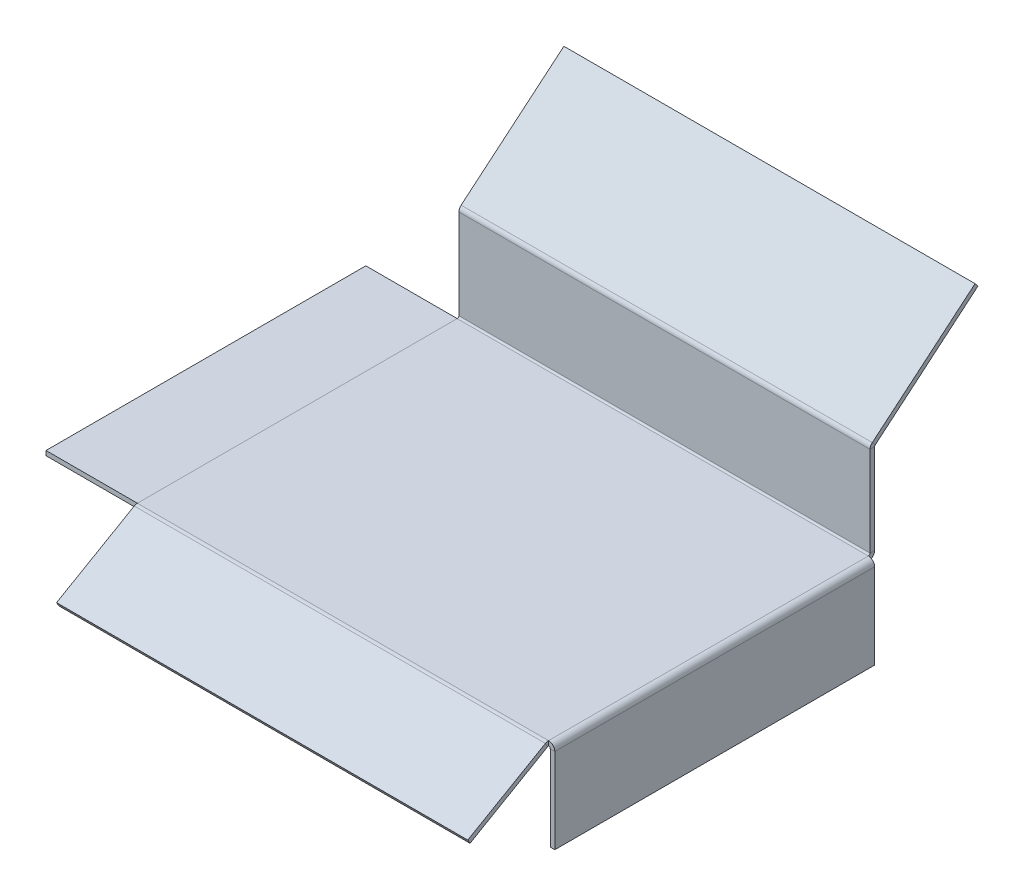
ISO-10303-21;
HEADER;
FILE_DESCRIPTION(('STEP AP214'),'2;1');
FILE_NAME('part.step','',(''),(''),'','','');
FILE_SCHEMA(('AUTOMOTIVE_DESIGN { 1 0 10303 214 1 1 1 1 }'));
ENDSEC;
DATA;
#1=APPLICATION_CONTEXT('core data for automotive mechanical design processes');
#2=APPLICATION_PROTOCOL_DEFINITION('international standard','automotive_design',2000,#1);
#3=PRODUCT_CONTEXT('',#1,'mechanical');
#4=PRODUCT('Part','Part','',(#3));
#5=PRODUCT_RELATED_PRODUCT_CATEGORY('part','',(#4));
#6=PRODUCT_DEFINITION_FORMATION('','',#4);
#7=PRODUCT_DEFINITION_CONTEXT('part definition',#1,'design');
#8=PRODUCT_DEFINITION('design','',#6,#7);
#9=PRODUCT_DEFINITION_SHAPE('','',#8);
#10=(LENGTH_UNIT() NAMED_UNIT(*) SI_UNIT(.MILLI.,.METRE.));
#11=(NAMED_UNIT(*) PLANE_ANGLE_UNIT() SI_UNIT($,.RADIAN.));
#12=(NAMED_UNIT(*) SI_UNIT($,.STERADIAN.) SOLID_ANGLE_UNIT());
#13=UNCERTAINTY_MEASURE_WITH_UNIT(LENGTH_MEASURE(1.E-05),#10,'distance_accuracy_value','');
#14=(GEOMETRIC_REPRESENTATION_CONTEXT(3) GLOBAL_UNCERTAINTY_ASSIGNED_CONTEXT((#13)) GLOBAL_UNIT_ASSIGNED_CONTEXT((#10,
#11,#12)) REPRESENTATION_CONTEXT('',''));
#15=CARTESIAN_POINT('',(0.,0.,0.));
#16=DIRECTION('',(0.,0.,1.));
#17=DIRECTION('',(1.,0.,0.));
#18=AXIS2_PLACEMENT_3D('',#15,#16,#17);
#19=CARTESIAN_POINT('',(-40.,-2.,0.));
#20=DIRECTION('',(0.,0.,-1.));
#21=DIRECTION('',(-1.,0.,0.));
#22=AXIS2_PLACEMENT_3D('',#19,#20,#21);
#23=PLANE('',#22);
#24=DIRECTION('',(0.,1.,0.));
#25=VECTOR('',#24,1.);
#26=CARTESIAN_POINT('',(0.,-2.,0.));
#27=LINE('',#26,#25);
#28=CARTESIAN_POINT('',(0.,-2.,0.));
#29=VERTEX_POINT('',#28);
#30=CARTESIAN_POINT('',(0.,0.,0.));
#31=VERTEX_POINT('',#30);
#32=EDGE_CURVE('E194',#29,#31,#27,.T.);
#33=ORIENTED_EDGE('',*,*,#32,.T.);
#34=DIRECTION('',(1.,0.,0.));
#35=VECTOR('',#34,1.);
#36=CARTESIAN_POINT('',(-40.,0.,0.));
#37=LINE('',#36,#35);
#38=CARTESIAN_POINT('',(-40.,0.,0.));
#39=VERTEX_POINT('',#38);
#40=EDGE_CURVE('E14',#39,#31,#37,.T.);
#41=ORIENTED_EDGE('',*,*,#40,.F.);
#42=DIRECTION('',(0.,1.,0.));
#43=VECTOR('',#42,1.);
#44=CARTESIAN_POINT('',(-40.,-2.,0.));
#45=LINE('',#44,#43);
#46=CARTESIAN_POINT('',(-40.,-2.,0.));
#47=VERTEX_POINT('',#46);
#48=EDGE_CURVE('E182',#47,#39,#45,.T.);
#49=ORIENTED_EDGE('',*,*,#48,.F.);
#50=DIRECTION('',(1.,0.,0.));
#51=VECTOR('',#50,1.);
#52=CARTESIAN_POINT('',(-40.,-2.,0.));
#53=LINE('',#52,#51);
#54=EDGE_CURVE('E190',#47,#29,#53,.T.);
#55=ORIENTED_EDGE('',*,*,#54,.T.);
#56=EDGE_LOOP('',(#33,#41,#49,#55));
#57=FACE_BOUND('',#56,.T.);
#58=ADVANCED_FACE('F131',(#57),#23,.F.);
#59=CARTESIAN_POINT('',(-40.,0.,0.));
#60=DIRECTION('',(0.,-1.,0.));
#61=DIRECTION('',(0.,0.,-1.));
#62=AXIS2_PLACEMENT_3D('',#59,#60,#61);
#63=PLANE('',#62);
#64=DIRECTION('',(0.,0.,-1.));
#65=VECTOR('',#64,1.);
#66=CARTESIAN_POINT('',(0.,0.,0.));
#67=LINE('',#66,#65);
#68=CARTESIAN_POINT('',(0.,0.,-140.));
#69=VERTEX_POINT('',#68);
#70=EDGE_CURVE('E186',#31,#69,#67,.T.);
#71=ORIENTED_EDGE('',*,*,#70,.T.);
#72=DIRECTION('',(1.,0.,0.));
#73=VECTOR('',#72,1.);
#74=CARTESIAN_POINT('',(-40.,0.,-140.));
#75=LINE('',#74,#73);
#76=CARTESIAN_POINT('',(-40.,0.,-140.));
#77=VERTEX_POINT('',#76);
#78=EDGE_CURVE('E139',#77,#69,#75,.T.);
#79=ORIENTED_EDGE('',*,*,#78,.F.);
#80=DIRECTION('',(0.,0.,-1.));
#81=VECTOR('',#80,1.);
#82=CARTESIAN_POINT('',(-40.,0.,0.));
#83=LINE('',#82,#81);
#84=EDGE_CURVE('E177',#39,#77,#83,.T.);
#85=ORIENTED_EDGE('',*,*,#84,.F.);
#86=ORIENTED_EDGE('',*,*,#40,.T.);
#87=EDGE_LOOP('',(#71,#79,#85,#86));
#88=FACE_BOUND('',#87,.T.);
#89=ADVANCED_FACE('F185',(#88),#63,.F.);
#90=CARTESIAN_POINT('',(-40.,0.,-140.));
#91=DIRECTION('',(0.,0.,1.));
#92=DIRECTION('',(1.,0.,0.));
#93=AXIS2_PLACEMENT_3D('',#90,#91,#92);
#94=PLANE('',#93);
#95=DIRECTION('',(0.,-1.,0.));
#96=VECTOR('',#95,1.);
#97=CARTESIAN_POINT('',(0.,0.,-140.));
#98=LINE('',#97,#96);
#99=CARTESIAN_POINT('',(0.,-2.,-140.));
#100=VERTEX_POINT('',#99);
#101=EDGE_CURVE('E164',#69,#100,#98,.T.);
#102=ORIENTED_EDGE('',*,*,#101,.T.);
#103=DIRECTION('',(1.,0.,0.));
#104=VECTOR('',#103,1.);
#105=CARTESIAN_POINT('',(-40.,-2.,-140.));
#106=LINE('',#105,#104);
#107=CARTESIAN_POINT('',(-40.,-2.,-140.));
#108=VERTEX_POINT('',#107);
#109=EDGE_CURVE('E187',#108,#100,#106,.T.);
#110=ORIENTED_EDGE('',*,*,#109,.F.);
#111=DIRECTION('',(0.,-1.,0.));
#112=VECTOR('',#111,1.);
#113=CARTESIAN_POINT('',(-40.,0.,-140.));
#114=LINE('',#113,#112);
#115=EDGE_CURVE('E180',#77,#108,#114,.T.);
#116=ORIENTED_EDGE('',*,*,#115,.F.);
#117=ORIENTED_EDGE('',*,*,#78,.T.);
#118=EDGE_LOOP('',(#102,#110,#116,#117));
#119=FACE_BOUND('',#118,.T.);
#120=ADVANCED_FACE('F188',(#119),#94,.F.);
#121=CARTESIAN_POINT('',(-40.,-2.,-140.));
#122=DIRECTION('',(0.,1.,0.));
#123=DIRECTION('',(0.,0.,1.));
#124=AXIS2_PLACEMENT_3D('',#121,#122,#123);
#125=PLANE('',#124);
#126=DIRECTION('',(0.,0.,1.));
#127=VECTOR('',#126,1.);
#128=CARTESIAN_POINT('',(0.,-2.,-140.));
#129=LINE('',#128,#127);
#130=EDGE_CURVE('E170',#100,#29,#129,.T.);
#131=ORIENTED_EDGE('',*,*,#130,.T.);
#132=ORIENTED_EDGE('',*,*,#54,.F.);
#133=DIRECTION('',(0.,0.,1.));
#134=VECTOR('',#133,1.);
#135=CARTESIAN_POINT('',(-40.,-2.,-140.));
#136=LINE('',#135,#134);
#137=EDGE_CURVE('E147',#108,#47,#136,.T.);
#138=ORIENTED_EDGE('',*,*,#137,.F.);
#139=ORIENTED_EDGE('',*,*,#109,.T.);
#140=EDGE_LOOP('',(#131,#132,#138,#139));
#141=FACE_BOUND('',#140,.T.);
#142=ADVANCED_FACE('F201',(#141),#125,.F.);
#143=CARTESIAN_POINT('',(-40.,0.,0.));
#144=DIRECTION('',(-1.,0.,0.));
#145=DIRECTION('',(0.,0.,1.));
#146=AXIS2_PLACEMENT_3D('',#143,#144,#145);
#147=PLANE('',#146);
#148=ORIENTED_EDGE('',*,*,#48,.T.);
#149=ORIENTED_EDGE('',*,*,#84,.T.);
#150=ORIENTED_EDGE('',*,*,#115,.T.);
#151=ORIENTED_EDGE('',*,*,#137,.T.);
#152=EDGE_LOOP('',(#148,#149,#150,#151));
#153=FACE_BOUND('',#152,.T.);
#154=ADVANCED_FACE('F178',(#153),#147,.T.);
#155=CARTESIAN_POINT('',(0.,0.,0.));
#156=DIRECTION('',(-1.,0.,0.));
#157=DIRECTION('',(0.,0.,1.));
#158=AXIS2_PLACEMENT_3D('',#155,#156,#157);
#159=PLANE('',#158);
#160=ORIENTED_EDGE('',*,*,#32,.F.);
#161=ORIENTED_EDGE('',*,*,#130,.F.);
#162=ORIENTED_EDGE('',*,*,#101,.F.);
#163=ORIENTED_EDGE('',*,*,#70,.F.);
#164=EDGE_LOOP('',(#160,#161,#162,#163));
#165=FACE_BOUND('',#164,.T.);
#166=ADVANCED_FACE('F204',(#165),#159,.F.);
#167=CLOSED_SHELL('',(#58,#89,#120,#142,#154,#166));
#168=MANIFOLD_SOLID_BREP('B2',#167);
#169=CARTESIAN_POINT('',(0.,43.,-142.7366));
#170=DIRECTION('',(1.,0.,0.));
#171=DIRECTION('',(0.,0.,-1.));
#172=AXIS2_PLACEMENT_3D('',#169,#170,#171);
#173=PLANE('',#172);
#174=DIRECTION('',(0.,0.,1.));
#175=VECTOR('',#174,1.);
#176=CARTESIAN_POINT('',(0.,40.0457032003385,-142.7366));
#177=LINE('',#176,#175);
#178=CARTESIAN_POINT('',(0.,40.0457032003385,-142.7366));
#179=VERTEX_POINT('',#178);
#180=CARTESIAN_POINT('',(0.,40.0457032003385,-140.7366));
#181=VERTEX_POINT('',#180);
#182=EDGE_CURVE('E472',#179,#181,#177,.T.);
#183=ORIENTED_EDGE('',*,*,#182,.F.);
#184=DIRECTION('',(0.,1.,0.));
#185=VECTOR('',#184,1.);
#186=CARTESIAN_POINT('',(0.,-4.58817914560018E-13,-142.7366));
#187=LINE('',#186,#185);
#188=CARTESIAN_POINT('',(0.,0.736600000000018,-142.7366));
#189=VERTEX_POINT('',#188);
#190=EDGE_CURVE('E483',#189,#179,#187,.T.);
#191=ORIENTED_EDGE('',*,*,#190,.F.);
#192=DIRECTION('',(0.,0.,1.));
#193=VECTOR('',#192,1.);
#194=CARTESIAN_POINT('',(0.,0.736600000000004,-140.7366));
#195=LINE('',#194,#193);
#196=CARTESIAN_POINT('',(0.,0.736599999999996,-140.7366));
#197=VERTEX_POINT('',#196);
#198=EDGE_CURVE('E498',#197,#189,#195,.F.);
#199=ORIENTED_EDGE('',*,*,#198,.F.);
#200=DIRECTION('',(0.,-1.,0.));
#201=VECTOR('',#200,1.);
#202=CARTESIAN_POINT('',(0.,43.,-140.7366));
#203=LINE('',#202,#201);
#204=EDGE_CURVE('E490',#197,#181,#203,.F.);
#205=ORIENTED_EDGE('',*,*,#204,.T.);
#206=EDGE_LOOP('',(#183,#191,#199,#205));
#207=FACE_BOUND('',#206,.T.);
#208=ADVANCED_FACE('F255',(#207),#173,.F.);
#209=CARTESIAN_POINT('',(180.,0.,-142.7366));
#210=DIRECTION('',(-1.,0.,0.));
#211=DIRECTION('',(0.,0.,1.));
#212=AXIS2_PLACEMENT_3D('',#209,#210,#211);
#213=PLANE('',#212);
#214=DIRECTION('',(0.,0.,1.));
#215=VECTOR('',#214,1.);
#216=CARTESIAN_POINT('',(180.,40.0457032003385,-142.7366));
#217=LINE('',#216,#215);
#218=CARTESIAN_POINT('',(180.,40.0457032003385,-142.7366));
#219=VERTEX_POINT('',#218);
#220=CARTESIAN_POINT('',(180.,40.0457032003385,-140.7366));
#221=VERTEX_POINT('',#220);
#222=EDGE_CURVE('E457',#219,#221,#217,.T.);
#223=ORIENTED_EDGE('',*,*,#222,.T.);
#224=DIRECTION('',(0.,1.,0.));
#225=VECTOR('',#224,1.);
#226=CARTESIAN_POINT('',(180.,0.,-140.7366));
#227=LINE('',#226,#225);
#228=CARTESIAN_POINT('',(180.,0.736599999999996,-140.7366));
#229=VERTEX_POINT('',#228);
#230=EDGE_CURVE('E487',#221,#229,#227,.F.);
#231=ORIENTED_EDGE('',*,*,#230,.T.);
#232=DIRECTION('',(0.,0.,1.));
#233=VECTOR('',#232,1.);
#234=CARTESIAN_POINT('',(180.,0.736600000000018,-142.7366));
#235=LINE('',#234,#233);
#236=CARTESIAN_POINT('',(180.,0.73659999999999,-142.7366));
#237=VERTEX_POINT('',#236);
#238=EDGE_CURVE('E475',#229,#237,#235,.F.);
#239=ORIENTED_EDGE('',*,*,#238,.T.);
#240=DIRECTION('',(0.,-1.,0.));
#241=VECTOR('',#240,1.);
#242=CARTESIAN_POINT('',(180.,-4.58817914560018E-13,-142.7366));
#243=LINE('',#242,#241);
#244=EDGE_CURVE('E479',#219,#237,#243,.T.);
#245=ORIENTED_EDGE('',*,*,#244,.F.);
#246=EDGE_LOOP('',(#223,#231,#239,#245));
#247=FACE_BOUND('',#246,.T.);
#248=ADVANCED_FACE('F709',(#247),#213,.F.);
#249=CARTESIAN_POINT('',(0.,-4.58817914560018E-13,-142.7366));
#250=DIRECTION('',(0.,0.,1.));
#251=DIRECTION('',(0.,-1.,0.));
#252=AXIS2_PLACEMENT_3D('',#249,#250,#251);
#253=PLANE('',#252);
#254=DIRECTION('',(1.,0.,0.));
#255=VECTOR('',#254,1.);
#256=CARTESIAN_POINT('',(180.,40.0457032003385,-142.7366));
#257=LINE('',#256,#255);
#258=EDGE_CURVE('E465',#219,#179,#257,.F.);
#259=ORIENTED_EDGE('',*,*,#258,.F.);
#260=ORIENTED_EDGE('',*,*,#244,.T.);
#261=DIRECTION('',(-1.,0.,0.));
#262=VECTOR('',#261,1.);
#263=CARTESIAN_POINT('',(180.,0.736600000000018,-142.7366));
#264=LINE('',#263,#262);
#265=EDGE_CURVE('E494',#189,#237,#264,.F.);
#266=ORIENTED_EDGE('',*,*,#265,.F.);
#267=ORIENTED_EDGE('',*,*,#190,.T.);
#268=EDGE_LOOP('',(#259,#260,#266,#267));
#269=FACE_BOUND('',#268,.T.);
#270=ADVANCED_FACE('F699',(#269),#253,.F.);
#271=CARTESIAN_POINT('',(0.,-4.51834951882331E-13,-140.7366));
#272=DIRECTION('',(0.,0.,1.));
#273=DIRECTION('',(0.,-1.,0.));
#274=AXIS2_PLACEMENT_3D('',#271,#272,#273);
#275=PLANE('',#274);
#276=ORIENTED_EDGE('',*,*,#230,.F.);
#277=DIRECTION('',(1.,0.,0.));
#278=VECTOR('',#277,1.);
#279=CARTESIAN_POINT('',(180.,40.0457032003385,-140.7366));
#280=LINE('',#279,#278);
#281=EDGE_CURVE('E450',#221,#181,#280,.F.);
#282=ORIENTED_EDGE('',*,*,#281,.T.);
#283=ORIENTED_EDGE('',*,*,#204,.F.);
#284=DIRECTION('',(-1.,0.,0.));
#285=VECTOR('',#284,1.);
#286=CARTESIAN_POINT('',(180.,0.736600000000004,-140.7366));
#287=LINE('',#286,#285);
#288=EDGE_CURVE('E502',#229,#197,#287,.T.);
#289=ORIENTED_EDGE('',*,*,#288,.F.);
#290=EDGE_LOOP('',(#276,#282,#283,#289));
#291=FACE_BOUND('',#290,.T.);
#292=ADVANCED_FACE('F692',(#291),#275,.T.);
#293=CARTESIAN_POINT('',(0.,-2.,0.));
#294=DIRECTION('',(-1.,0.,0.));
#295=DIRECTION('',(0.,0.,1.));
#296=AXIS2_PLACEMENT_3D('',#293,#294,#295);
#297=PLANE('',#296);
#298=DIRECTION('',(0.,0.,1.));
#299=VECTOR('',#298,1.);
#300=CARTESIAN_POINT('',(0.,0.,0.));
#301=LINE('',#300,#299);
#302=CARTESIAN_POINT('',(0.,0.,-140.));
#303=VERTEX_POINT('',#302);
#304=CARTESIAN_POINT('',(0.,0.,0.));
#305=VERTEX_POINT('',#304);
#306=EDGE_CURVE('E281',#303,#305,#301,.T.);
#307=ORIENTED_EDGE('',*,*,#306,.F.);
#308=DIRECTION('',(0.,1.,0.));
#309=VECTOR('',#308,1.);
#310=CARTESIAN_POINT('',(0.,-2.,-140.));
#311=LINE('',#310,#309);
#312=CARTESIAN_POINT('',(0.,-2.00000000000001,-140.));
#313=VERTEX_POINT('',#312);
#314=EDGE_CURVE('E129',#313,#303,#311,.T.);
#315=ORIENTED_EDGE('',*,*,#314,.F.);
#316=DIRECTION('',(0.,0.,1.));
#317=VECTOR('',#316,1.);
#318=CARTESIAN_POINT('',(0.,-2.,0.));
#319=LINE('',#318,#317);
#320=CARTESIAN_POINT('',(0.,-2.00000000000005,0.));
#321=VERTEX_POINT('',#320);
#322=EDGE_CURVE('E639',#313,#321,#319,.T.);
#323=ORIENTED_EDGE('',*,*,#322,.T.);
#324=DIRECTION('',(0.,1.,0.));
#325=VECTOR('',#324,1.);
#326=CARTESIAN_POINT('',(0.,-2.,0.));
#327=LINE('',#326,#325);
#328=EDGE_CURVE('E259',#321,#305,#327,.T.);
#329=ORIENTED_EDGE('',*,*,#328,.T.);
#330=EDGE_LOOP('',(#307,#315,#323,#329));
#331=FACE_BOUND('',#330,.T.);
#332=ADVANCED_FACE('F257',(#331),#297,.T.);
#333=CARTESIAN_POINT('',(0.,-2.,0.));
#334=DIRECTION('',(0.,-1.,0.));
#335=DIRECTION('',(0.,0.,-1.));
#336=AXIS2_PLACEMENT_3D('',#333,#334,#335);
#337=PLANE('',#336);
#338=ORIENTED_EDGE('',*,*,#322,.F.);
#339=DIRECTION('',(-1.,0.,0.));
#340=VECTOR('',#339,1.);
#341=CARTESIAN_POINT('',(0.,-2.,-140.));
#342=LINE('',#341,#340);
#343=CARTESIAN_POINT('',(180.,-2.,-140.));
#344=VERTEX_POINT('',#343);
#345=EDGE_CURVE('E650',#344,#313,#342,.T.);
#346=ORIENTED_EDGE('',*,*,#345,.F.);
#347=DIRECTION('',(0.,0.,-1.));
#348=VECTOR('',#347,1.);
#349=CARTESIAN_POINT('',(180.,-2.,0.));
#350=LINE('',#349,#348);
#351=CARTESIAN_POINT('',(180.,-2.,0.));
#352=VERTEX_POINT('',#351);
#353=EDGE_CURVE('E647',#352,#344,#350,.T.);
#354=ORIENTED_EDGE('',*,*,#353,.F.);
#355=DIRECTION('',(1.,0.,0.));
#356=VECTOR('',#355,1.);
#357=CARTESIAN_POINT('',(0.,-2.,0.));
#358=LINE('',#357,#356);
#359=EDGE_CURVE('E643',#321,#352,#358,.T.);
#360=ORIENTED_EDGE('',*,*,#359,.F.);
#361=EDGE_LOOP('',(#338,#346,#354,#360));
#362=FACE_BOUND('',#361,.T.);
#363=ADVANCED_FACE('F820',(#362),#337,.T.);
#364=CARTESIAN_POINT('',(0.,0.,0.));
#365=DIRECTION('',(0.,-1.,0.));
#366=DIRECTION('',(0.,0.,-1.));
#367=AXIS2_PLACEMENT_3D('',#364,#365,#366);
#368=PLANE('',#367);
#369=ORIENTED_EDGE('',*,*,#306,.T.);
#370=DIRECTION('',(1.,0.,0.));
#371=VECTOR('',#370,1.);
#372=CARTESIAN_POINT('',(0.,0.,0.));
#373=LINE('',#372,#371);
#374=CARTESIAN_POINT('',(180.,0.,0.));
#375=VERTEX_POINT('',#374);
#376=EDGE_CURVE('E656',#305,#375,#373,.T.);
#377=ORIENTED_EDGE('',*,*,#376,.T.);
#378=DIRECTION('',(0.,0.,-1.));
#379=VECTOR('',#378,1.);
#380=CARTESIAN_POINT('',(180.,0.,0.));
#381=LINE('',#380,#379);
#382=CARTESIAN_POINT('',(180.,0.,-140.));
#383=VERTEX_POINT('',#382);
#384=EDGE_CURVE('E660',#375,#383,#381,.T.);
#385=ORIENTED_EDGE('',*,*,#384,.T.);
#386=DIRECTION('',(-1.,0.,0.));
#387=VECTOR('',#386,1.);
#388=CARTESIAN_POINT('',(0.,0.,-140.));
#389=LINE('',#388,#387);
#390=EDGE_CURVE('E644',#383,#303,#389,.T.);
#391=ORIENTED_EDGE('',*,*,#390,.T.);
#392=EDGE_LOOP('',(#369,#377,#385,#391));
#393=FACE_BOUND('',#392,.T.);
#394=ADVANCED_FACE('F679',(#393),#368,.F.);
#395=CARTESIAN_POINT('',(180.,-2.73660000000001,-140.));
#396=DIRECTION('',(0.,0.,-1.));
#397=DIRECTION('',(-1.,0.,0.));
#398=AXIS2_PLACEMENT_3D('',#395,#396,#397);
#399=PLANE('',#398);
#400=DIRECTION('',(-1.,0.,0.));
#401=VECTOR('',#400,1.);
#402=CARTESIAN_POINT('',(182.7366,-2.7366,-140.));
#403=LINE('',#402,#401);
#404=CARTESIAN_POINT('',(180.7366,-2.73660000000001,-140.));
#405=VERTEX_POINT('',#404);
#406=CARTESIAN_POINT('',(182.7366,-2.7366,-140.));
#407=VERTEX_POINT('',#406);
#408=EDGE_CURVE('E570',#405,#407,#403,.F.);
#409=ORIENTED_EDGE('',*,*,#408,.F.);
#410=CARTESIAN_POINT('',(180.,-2.73660000000001,-140.));
#411=DIRECTION('',(0.,0.,1.));
#412=DIRECTION('',(1.,0.,0.));
#413=AXIS2_PLACEMENT_3D('',#410,#411,#412);
#414=CIRCLE('',#413,0.736600000000004);
#415=EDGE_CURVE('E632',#344,#405,#414,.F.);
#416=ORIENTED_EDGE('',*,*,#415,.F.);
#417=DIRECTION('',(0.,1.,0.));
#418=VECTOR('',#417,1.);
#419=CARTESIAN_POINT('',(180.,-2.,-140.));
#420=LINE('',#419,#418);
#421=EDGE_CURVE('E265',#344,#383,#420,.T.);
#422=ORIENTED_EDGE('',*,*,#421,.T.);
#423=CARTESIAN_POINT('',(180.,-2.73660000000001,-140.));
#424=DIRECTION('',(0.,0.,1.));
#425=DIRECTION('',(1.,0.,0.));
#426=AXIS2_PLACEMENT_3D('',#423,#424,#425);
#427=CIRCLE('',#426,2.7366);
#428=EDGE_CURVE('E624',#383,#407,#427,.F.);
#429=ORIENTED_EDGE('',*,*,#428,.T.);
#430=EDGE_LOOP('',(#409,#416,#422,#429));
#431=FACE_BOUND('',#430,.T.);
#432=ADVANCED_FACE('F813',(#431),#399,.T.);
#433=CARTESIAN_POINT('',(180.,-2.73660000000001,0.));
#434=DIRECTION('',(0.,0.,-1.));
#435=DIRECTION('',(-1.,0.,0.));
#436=AXIS2_PLACEMENT_3D('',#433,#434,#435);
#437=PLANE('',#436);
#438=CARTESIAN_POINT('',(180.,-2.73660000000001,0.));
#439=DIRECTION('',(0.,0.,1.));
#440=DIRECTION('',(1.,0.,0.));
#441=AXIS2_PLACEMENT_3D('',#438,#439,#440);
#442=CIRCLE('',#441,0.736600000000004);
#443=CARTESIAN_POINT('',(180.7366,-2.73660000000001,0.));
#444=VERTEX_POINT('',#443);
#445=EDGE_CURVE('E586',#444,#352,#442,.T.);
#446=ORIENTED_EDGE('',*,*,#445,.F.);
#447=DIRECTION('',(-1.,0.,0.));
#448=VECTOR('',#447,1.);
#449=CARTESIAN_POINT('',(180.7366,-2.73660000000001,0.));
#450=LINE('',#449,#448);
#451=CARTESIAN_POINT('',(182.7366,-2.7366,0.));
#452=VERTEX_POINT('',#451);
#453=EDGE_CURVE('E614',#444,#452,#450,.F.);
#454=ORIENTED_EDGE('',*,*,#453,.T.);
#455=CARTESIAN_POINT('',(180.,-2.73660000000001,0.));
#456=DIRECTION('',(0.,0.,1.));
#457=DIRECTION('',(1.,0.,0.));
#458=AXIS2_PLACEMENT_3D('',#455,#456,#457);
#459=CIRCLE('',#458,2.7366);
#460=EDGE_CURVE('E628',#452,#375,#459,.T.);
#461=ORIENTED_EDGE('',*,*,#460,.T.);
#462=DIRECTION('',(0.,1.,0.));
#463=VECTOR('',#462,1.);
#464=CARTESIAN_POINT('',(180.,-2.,0.));
#465=LINE('',#464,#463);
#466=EDGE_CURVE('E668',#352,#375,#465,.T.);
#467=ORIENTED_EDGE('',*,*,#466,.F.);
#468=EDGE_LOOP('',(#446,#454,#461,#467));
#469=FACE_BOUND('',#468,.T.);
#470=ADVANCED_FACE('F808',(#469),#437,.F.);
#471=CARTESIAN_POINT('',(180.,-2.73660000000001,0.));
#472=DIRECTION('',(0.,0.,1.));
#473=DIRECTION('',(1.,0.,0.));
#474=AXIS2_PLACEMENT_3D('',#471,#472,#473);
#475=CYLINDRICAL_SURFACE('',#474,2.7366);
#476=ORIENTED_EDGE('',*,*,#384,.F.);
#477=ORIENTED_EDGE('',*,*,#460,.F.);
#478=DIRECTION('',(0.,0.,1.));
#479=VECTOR('',#478,1.);
#480=CARTESIAN_POINT('',(182.7366,-2.7366,-140.));
#481=LINE('',#480,#479);
#482=EDGE_CURVE('E611',#452,#407,#481,.F.);
#483=ORIENTED_EDGE('',*,*,#482,.T.);
#484=ORIENTED_EDGE('',*,*,#428,.F.);
#485=EDGE_LOOP('',(#476,#477,#483,#484));
#486=FACE_BOUND('',#485,.T.);
#487=ADVANCED_FACE('F805',(#486),#475,.T.);
#488=CARTESIAN_POINT('',(180.,-2.73660000000001,0.));
#489=DIRECTION('',(0.,0.,1.));
#490=DIRECTION('',(1.,0.,0.));
#491=AXIS2_PLACEMENT_3D('',#488,#489,#490);
#492=CYLINDRICAL_SURFACE('',#491,0.736600000000004);
#493=ORIENTED_EDGE('',*,*,#353,.T.);
#494=ORIENTED_EDGE('',*,*,#415,.T.);
#495=DIRECTION('',(0.,0.,1.));
#496=VECTOR('',#495,1.);
#497=CARTESIAN_POINT('',(180.7366,-2.73660000000001,-140.));
#498=LINE('',#497,#496);
#499=EDGE_CURVE('E618',#405,#444,#498,.T.);
#500=ORIENTED_EDGE('',*,*,#499,.T.);
#501=ORIENTED_EDGE('',*,*,#445,.T.);
#502=EDGE_LOOP('',(#493,#494,#500,#501));
#503=FACE_BOUND('',#502,.T.);
#504=ADVANCED_FACE('F803',(#503),#492,.F.);
#505=CARTESIAN_POINT('',(182.7366,-40.,0.));
#506=DIRECTION('',(0.,0.,-1.));
#507=DIRECTION('',(-1.,0.,0.));
#508=AXIS2_PLACEMENT_3D('',#505,#506,#507);
#509=PLANE('',#508);
#510=ORIENTED_EDGE('',*,*,#453,.F.);
#511=DIRECTION('',(0.,1.,0.));
#512=VECTOR('',#511,1.);
#513=CARTESIAN_POINT('',(180.7366,-40.,0.));
#514=LINE('',#513,#512);
#515=CARTESIAN_POINT('',(180.7366,-40.,0.));
#516=VERTEX_POINT('',#515);
#517=EDGE_CURVE('E608',#444,#516,#514,.F.);
#518=ORIENTED_EDGE('',*,*,#517,.T.);
#519=DIRECTION('',(-1.,0.,0.));
#520=VECTOR('',#519,1.);
#521=CARTESIAN_POINT('',(182.7366,-40.,0.));
#522=LINE('',#521,#520);
#523=CARTESIAN_POINT('',(182.7366,-40.,0.));
#524=VERTEX_POINT('',#523);
#525=EDGE_CURVE('E582',#524,#516,#522,.T.);
#526=ORIENTED_EDGE('',*,*,#525,.F.);
#527=DIRECTION('',(0.,-1.,0.));
#528=VECTOR('',#527,1.);
#529=CARTESIAN_POINT('',(182.7366,6.64351858837318E-13,0.));
#530=LINE('',#529,#528);
#531=EDGE_CURVE('E598',#452,#524,#530,.T.);
#532=ORIENTED_EDGE('',*,*,#531,.F.);
#533=EDGE_LOOP('',(#510,#518,#526,#532));
#534=FACE_BOUND('',#533,.T.);
#535=ADVANCED_FACE('F796',(#534),#509,.F.);
#536=CARTESIAN_POINT('',(182.7366,-1.99999999999999,-140.));
#537=DIRECTION('',(0.,0.,1.));
#538=DIRECTION('',(1.,0.,0.));
#539=AXIS2_PLACEMENT_3D('',#536,#537,#538);
#540=PLANE('',#539);
#541=ORIENTED_EDGE('',*,*,#408,.T.);
#542=DIRECTION('',(0.,1.,0.));
#543=VECTOR('',#542,1.);
#544=CARTESIAN_POINT('',(182.7366,6.64351858837318E-13,-140.));
#545=LINE('',#544,#543);
#546=CARTESIAN_POINT('',(182.7366,-40.,-140.));
#547=VERTEX_POINT('',#546);
#548=EDGE_CURVE('E591',#547,#407,#545,.T.);
#549=ORIENTED_EDGE('',*,*,#548,.F.);
#550=DIRECTION('',(-1.,0.,0.));
#551=VECTOR('',#550,1.);
#552=CARTESIAN_POINT('',(182.7366,-40.,-140.));
#553=LINE('',#552,#551);
#554=CARTESIAN_POINT('',(180.7366,-40.,-140.));
#555=VERTEX_POINT('',#554);
#556=EDGE_CURVE('E587',#547,#555,#553,.T.);
#557=ORIENTED_EDGE('',*,*,#556,.T.);
#558=DIRECTION('',(0.,-1.,0.));
#559=VECTOR('',#558,1.);
#560=CARTESIAN_POINT('',(180.7366,-2.,-140.));
#561=LINE('',#560,#559);
#562=EDGE_CURVE('E601',#555,#405,#561,.F.);
#563=ORIENTED_EDGE('',*,*,#562,.T.);
#564=EDGE_LOOP('',(#541,#549,#557,#563));
#565=FACE_BOUND('',#564,.T.);
#566=ADVANCED_FACE('F789',(#565),#540,.F.);
#567=CARTESIAN_POINT('',(182.7366,6.64351858837318E-13,0.));
#568=DIRECTION('',(-1.,0.,0.));
#569=DIRECTION('',(0.,-1.,0.));
#570=AXIS2_PLACEMENT_3D('',#567,#568,#569);
#571=PLANE('',#570);
#572=ORIENTED_EDGE('',*,*,#482,.F.);
#573=ORIENTED_EDGE('',*,*,#531,.T.);
#574=DIRECTION('',(0.,0.,-1.));
#575=VECTOR('',#574,1.);
#576=CARTESIAN_POINT('',(182.7366,-40.,0.));
#577=LINE('',#576,#575);
#578=EDGE_CURVE('E595',#524,#547,#577,.T.);
#579=ORIENTED_EDGE('',*,*,#578,.T.);
#580=ORIENTED_EDGE('',*,*,#548,.T.);
#581=EDGE_LOOP('',(#572,#573,#579,#580));
#582=FACE_BOUND('',#581,.T.);
#583=ADVANCED_FACE('F785',(#582),#571,.F.);
#584=CARTESIAN_POINT('',(180.7366,6.57368896159632E-13,0.));
#585=DIRECTION('',(-1.,0.,0.));
#586=DIRECTION('',(0.,-1.,0.));
#587=AXIS2_PLACEMENT_3D('',#584,#585,#586);
#588=PLANE('',#587);
#589=ORIENTED_EDGE('',*,*,#517,.F.);
#590=ORIENTED_EDGE('',*,*,#499,.F.);
#591=ORIENTED_EDGE('',*,*,#562,.F.);
#592=DIRECTION('',(0.,0.,1.));
#593=VECTOR('',#592,1.);
#594=CARTESIAN_POINT('',(180.7366,-40.,-140.));
#595=LINE('',#594,#593);
#596=EDGE_CURVE('E605',#516,#555,#595,.F.);
#597=ORIENTED_EDGE('',*,*,#596,.F.);
#598=EDGE_LOOP('',(#589,#590,#591,#597));
#599=FACE_BOUND('',#598,.T.);
#600=ADVANCED_FACE('F788',(#599),#588,.T.);
#601=CARTESIAN_POINT('',(182.7366,-40.,-140.));
#602=DIRECTION('',(0.,1.,0.));
#603=DIRECTION('',(-1.,0.,0.));
#604=AXIS2_PLACEMENT_3D('',#601,#602,#603);
#605=PLANE('',#604);
#606=ORIENTED_EDGE('',*,*,#596,.T.);
#607=ORIENTED_EDGE('',*,*,#556,.F.);
#608=ORIENTED_EDGE('',*,*,#578,.F.);
#609=ORIENTED_EDGE('',*,*,#525,.T.);
#610=EDGE_LOOP('',(#606,#607,#608,#609));
#611=FACE_BOUND('',#610,.T.);
#612=ADVANCED_FACE('F782',(#611),#605,.F.);
#613=CARTESIAN_POINT('',(180.,-2.73659999999998,0.));
#614=DIRECTION('',(1.,0.,0.));
#615=DIRECTION('',(0.,1.,0.));
#616=AXIS2_PLACEMENT_3D('',#613,#614,#615);
#617=PLANE('',#616);
#618=DIRECTION('',(0.,-0.866025403784442,-0.499999999999995));
#619=VECTOR('',#618,1.);
#620=CARTESIAN_POINT('',(180.,-0.366634880003501,1.36829999999999));
#621=LINE('',#620,#619);
#622=CARTESIAN_POINT('',(180.,-2.09868568757238,0.368299999999987));
#623=VERTEX_POINT('',#622);
#624=CARTESIAN_POINT('',(180.,-0.366634880003496,1.36829999999998));
#625=VERTEX_POINT('',#624);
#626=EDGE_CURVE('E512',#623,#625,#621,.F.);
#627=ORIENTED_EDGE('',*,*,#626,.F.);
#628=CARTESIAN_POINT('',(180.,-2.73659999999998,0.));
#629=DIRECTION('',(-1.,0.,0.));
#630=DIRECTION('',(0.,-1.,0.));
#631=AXIS2_PLACEMENT_3D('',#628,#629,#630);
#632=CIRCLE('',#631,0.736599999999973);
#633=EDGE_CURVE('E575',#352,#623,#632,.F.);
#634=ORIENTED_EDGE('',*,*,#633,.F.);
#635=ORIENTED_EDGE('',*,*,#466,.T.);
#636=CARTESIAN_POINT('',(180.,-2.73659999999998,0.));
#637=DIRECTION('',(-1.,0.,0.));
#638=DIRECTION('',(0.,-1.,0.));
#639=AXIS2_PLACEMENT_3D('',#636,#637,#638);
#640=CIRCLE('',#639,2.73659999999997);
#641=EDGE_CURVE('E566',#375,#625,#640,.F.);
#642=ORIENTED_EDGE('',*,*,#641,.T.);
#643=EDGE_LOOP('',(#627,#634,#635,#642));
#644=FACE_BOUND('',#643,.T.);
#645=ADVANCED_FACE('F779',(#644),#617,.T.);
#646=CARTESIAN_POINT('',(0.,-2.73660000000003,0.));
#647=DIRECTION('',(1.,0.,0.));
#648=DIRECTION('',(0.,1.,0.));
#649=AXIS2_PLACEMENT_3D('',#646,#647,#648);
#650=PLANE('',#649);
#651=CARTESIAN_POINT('',(0.,-2.73660000000003,0.));
#652=DIRECTION('',(-1.,0.,0.));
#653=DIRECTION('',(0.,-1.,0.));
#654=AXIS2_PLACEMENT_3D('',#651,#652,#653);
#655=CIRCLE('',#654,0.736599999999973);
#656=CARTESIAN_POINT('',(0.,-2.09868568757243,0.36829999999998));
#657=VERTEX_POINT('',#656);
#658=EDGE_CURVE('E528',#657,#321,#655,.T.);
#659=ORIENTED_EDGE('',*,*,#658,.F.);
#660=DIRECTION('',(0.,-0.866025403784442,-0.499999999999995));
#661=VECTOR('',#660,1.);
#662=CARTESIAN_POINT('',(0.,-2.09868568757238,0.368299999999996));
#663=LINE('',#662,#661);
#664=CARTESIAN_POINT('',(0.,-0.366634880003498,1.36829999999999));
#665=VERTEX_POINT('',#664);
#666=EDGE_CURVE('E556',#657,#665,#663,.F.);
#667=ORIENTED_EDGE('',*,*,#666,.T.);
#668=CARTESIAN_POINT('',(0.,-2.73660000000003,0.));
#669=DIRECTION('',(-1.,0.,0.));
#670=DIRECTION('',(0.,-1.,0.));
#671=AXIS2_PLACEMENT_3D('',#668,#669,#670);
#672=CIRCLE('',#671,2.73659999999997);
#673=EDGE_CURVE('E571',#665,#305,#672,.T.);
#674=ORIENTED_EDGE('',*,*,#673,.T.);
#675=ORIENTED_EDGE('',*,*,#328,.F.);
#676=EDGE_LOOP('',(#659,#667,#674,#675));
#677=FACE_BOUND('',#676,.T.);
#678=ADVANCED_FACE('F774',(#677),#650,.F.);
#679=CARTESIAN_POINT('',(0.,-2.73660000000003,0.));
#680=DIRECTION('',(-1.,0.,0.));
#681=DIRECTION('',(0.,0.866025403784442,0.499999999999995));
#682=AXIS2_PLACEMENT_3D('',#679,#680,#681);
#683=CYLINDRICAL_SURFACE('',#682,2.73659999999997);
#684=ORIENTED_EDGE('',*,*,#376,.F.);
#685=ORIENTED_EDGE('',*,*,#673,.F.);
#686=DIRECTION('',(-1.,0.,0.));
#687=VECTOR('',#686,1.);
#688=CARTESIAN_POINT('',(180.,-0.366634880003502,1.36829999999999));
#689=LINE('',#688,#687);
#690=EDGE_CURVE('E553',#665,#625,#689,.F.);
#691=ORIENTED_EDGE('',*,*,#690,.T.);
#692=ORIENTED_EDGE('',*,*,#641,.F.);
#693=EDGE_LOOP('',(#684,#685,#691,#692));
#694=FACE_BOUND('',#693,.T.);
#695=ADVANCED_FACE('F771',(#694),#683,.T.);
#696=CARTESIAN_POINT('',(0.,-2.73660000000003,0.));
#697=DIRECTION('',(-1.,0.,0.));
#698=DIRECTION('',(0.,0.866025403784442,0.499999999999995));
#699=AXIS2_PLACEMENT_3D('',#696,#697,#698);
#700=CYLINDRICAL_SURFACE('',#699,0.736599999999973);
#701=ORIENTED_EDGE('',*,*,#359,.T.);
#702=ORIENTED_EDGE('',*,*,#633,.T.);
#703=DIRECTION('',(-1.,0.,0.));
#704=VECTOR('',#703,1.);
#705=CARTESIAN_POINT('',(180.,-2.09868568757238,0.368299999999997));
#706=LINE('',#705,#704);
#707=EDGE_CURVE('E560',#623,#657,#706,.T.);
#708=ORIENTED_EDGE('',*,*,#707,.T.);
#709=ORIENTED_EDGE('',*,*,#658,.T.);
#710=EDGE_LOOP('',(#701,#702,#708,#709));
#711=FACE_BOUND('',#710,.T.);
#712=ADVANCED_FACE('F769',(#711),#700,.F.);
#713=CARTESIAN_POINT('',(0.,-19.9999999999998,35.3742859113847));
#714=DIRECTION('',(1.,0.,0.));
#715=DIRECTION('',(0.,1.,0.));
#716=AXIS2_PLACEMENT_3D('',#713,#714,#715);
#717=PLANE('',#716);
#718=ORIENTED_EDGE('',*,*,#666,.F.);
#719=DIRECTION('',(0.,0.499999999999995,-0.866025403784442));
#720=VECTOR('',#719,1.);
#721=CARTESIAN_POINT('',(0.,-21.7320508075687,34.3742859113847));
#722=LINE('',#721,#720);
#723=CARTESIAN_POINT('',(0.,-21.7320508075687,34.3742859113847));
#724=VERTEX_POINT('',#723);
#725=EDGE_CURVE('E550',#657,#724,#722,.F.);
#726=ORIENTED_EDGE('',*,*,#725,.T.);
#727=DIRECTION('',(0.,-0.866025403784442,-0.499999999999995));
#728=VECTOR('',#727,1.);
#729=CARTESIAN_POINT('',(0.,-19.9999999999998,35.3742859113847));
#730=LINE('',#729,#728);
#731=CARTESIAN_POINT('',(0.,-19.9999999999998,35.3742859113847));
#732=VERTEX_POINT('',#731);
#733=EDGE_CURVE('E524',#732,#724,#730,.T.);
#734=ORIENTED_EDGE('',*,*,#733,.F.);
#735=DIRECTION('',(0.,-0.499999999999995,0.866025403784442));
#736=VECTOR('',#735,1.);
#737=CARTESIAN_POINT('',(0.,0.232050807568873,0.33134597136032));
#738=LINE('',#737,#736);
#739=EDGE_CURVE('E540',#665,#732,#738,.T.);
#740=ORIENTED_EDGE('',*,*,#739,.F.);
#741=EDGE_LOOP('',(#718,#726,#734,#740));
#742=FACE_BOUND('',#741,.T.);
#743=ADVANCED_FACE('F762',(#742),#717,.F.);
#744=CARTESIAN_POINT('',(180.,-0.267949192431121,1.19737137514475));
#745=DIRECTION('',(-1.,0.,0.));
#746=DIRECTION('',(0.,-1.,0.));
#747=AXIS2_PLACEMENT_3D('',#744,#745,#746);
#748=PLANE('',#747);
#749=ORIENTED_EDGE('',*,*,#626,.T.);
#750=DIRECTION('',(0.,0.499999999999995,-0.866025403784442));
#751=VECTOR('',#750,1.);
#752=CARTESIAN_POINT('',(180.,0.232050807568869,0.331345971360318));
#753=LINE('',#752,#751);
#754=CARTESIAN_POINT('',(180.,-19.9999999999998,35.3742859113847));
#755=VERTEX_POINT('',#754);
#756=EDGE_CURVE('E533',#755,#625,#753,.T.);
#757=ORIENTED_EDGE('',*,*,#756,.F.);
#758=DIRECTION('',(0.,-0.866025403784442,-0.499999999999995));
#759=VECTOR('',#758,1.);
#760=CARTESIAN_POINT('',(180.,-19.9999999999998,35.3742859113847));
#761=LINE('',#760,#759);
#762=CARTESIAN_POINT('',(180.,-21.7320508075687,34.3742859113847));
#763=VERTEX_POINT('',#762);
#764=EDGE_CURVE('E529',#755,#763,#761,.T.);
#765=ORIENTED_EDGE('',*,*,#764,.T.);
#766=DIRECTION('',(0.,-0.499999999999995,0.866025403784442));
#767=VECTOR('',#766,1.);
#768=CARTESIAN_POINT('',(180.,-2.00000000000001,0.197371375144763));
#769=LINE('',#768,#767);
#770=EDGE_CURVE('E543',#763,#623,#769,.F.);
#771=ORIENTED_EDGE('',*,*,#770,.T.);
#772=EDGE_LOOP('',(#749,#757,#765,#771));
#773=FACE_BOUND('',#772,.T.);
#774=ADVANCED_FACE('F755',(#773),#748,.F.);
#775=CARTESIAN_POINT('',(0.,0.232050807568873,0.33134597136032));
#776=DIRECTION('',(0.,-0.866025403784442,-0.499999999999995));
#777=DIRECTION('',(0.,0.499999999999995,-0.866025403784442));
#778=AXIS2_PLACEMENT_3D('',#775,#776,#777);
#779=PLANE('',#778);
#780=ORIENTED_EDGE('',*,*,#690,.F.);
#781=ORIENTED_EDGE('',*,*,#739,.T.);
#782=DIRECTION('',(1.,0.,0.));
#783=VECTOR('',#782,1.);
#784=CARTESIAN_POINT('',(0.,-19.9999999999998,35.3742859113847));
#785=LINE('',#784,#783);
#786=EDGE_CURVE('E537',#732,#755,#785,.T.);
#787=ORIENTED_EDGE('',*,*,#786,.T.);
#788=ORIENTED_EDGE('',*,*,#756,.T.);
#789=EDGE_LOOP('',(#780,#781,#787,#788));
#790=FACE_BOUND('',#789,.T.);
#791=ADVANCED_FACE('F751',(#790),#779,.F.);
#792=CARTESIAN_POINT('',(0.,-1.50000000000001,-0.66865402863967));
#793=DIRECTION('',(0.,-0.866025403784442,-0.499999999999995));
#794=DIRECTION('',(0.,0.499999999999995,-0.866025403784442));
#795=AXIS2_PLACEMENT_3D('',#792,#793,#794);
#796=PLANE('',#795);
#797=ORIENTED_EDGE('',*,*,#725,.F.);
#798=ORIENTED_EDGE('',*,*,#707,.F.);
#799=ORIENTED_EDGE('',*,*,#770,.F.);
#800=DIRECTION('',(-1.,0.,0.));
#801=VECTOR('',#800,1.);
#802=CARTESIAN_POINT('',(180.,-21.7320508075687,34.3742859113847));
#803=LINE('',#802,#801);
#804=EDGE_CURVE('E547',#724,#763,#803,.F.);
#805=ORIENTED_EDGE('',*,*,#804,.F.);
#806=EDGE_LOOP('',(#797,#798,#799,#805));
#807=FACE_BOUND('',#806,.T.);
#808=ADVANCED_FACE('F754',(#807),#796,.T.);
#809=CARTESIAN_POINT('',(180.,-19.9999999999998,35.3742859113847));
#810=DIRECTION('',(0.,0.499999999999995,-0.866025403784442));
#811=DIRECTION('',(0.,0.866025403784442,0.499999999999995));
#812=AXIS2_PLACEMENT_3D('',#809,#810,#811);
#813=PLANE('',#812);
#814=ORIENTED_EDGE('',*,*,#804,.T.);
#815=ORIENTED_EDGE('',*,*,#764,.F.);
#816=ORIENTED_EDGE('',*,*,#786,.F.);
#817=ORIENTED_EDGE('',*,*,#733,.T.);
#818=EDGE_LOOP('',(#814,#815,#816,#817));
#819=FACE_BOUND('',#818,.T.);
#820=ADVANCED_FACE('F748',(#819),#813,.F.);
#821=CARTESIAN_POINT('',(180.,0.736599999999999,-140.));
#822=DIRECTION('',(1.,0.,0.));
#823=DIRECTION('',(0.,0.,-1.));
#824=AXIS2_PLACEMENT_3D('',#821,#822,#823);
#825=PLANE('',#824);
#826=ORIENTED_EDGE('',*,*,#238,.F.);
#827=CARTESIAN_POINT('',(180.,0.736599999999999,-140.));
#828=DIRECTION('',(-1.,0.,0.));
#829=DIRECTION('',(0.,0.,1.));
#830=AXIS2_PLACEMENT_3D('',#827,#828,#829);
#831=CIRCLE('',#830,0.736600000000004);
#832=EDGE_CURVE('E517',#383,#229,#831,.F.);
#833=ORIENTED_EDGE('',*,*,#832,.F.);
#834=ORIENTED_EDGE('',*,*,#421,.F.);
#835=CARTESIAN_POINT('',(180.,0.736599999999999,-140.));
#836=DIRECTION('',(-1.,0.,0.));
#837=DIRECTION('',(0.,0.,1.));
#838=AXIS2_PLACEMENT_3D('',#835,#836,#837);
#839=CIRCLE('',#838,2.7366);
#840=EDGE_CURVE('E508',#344,#237,#839,.F.);
#841=ORIENTED_EDGE('',*,*,#840,.T.);
#842=EDGE_LOOP('',(#826,#833,#834,#841));
#843=FACE_BOUND('',#842,.T.);
#844=ADVANCED_FACE('F707',(#843),#825,.T.);
#845=CARTESIAN_POINT('',(0.,0.736599999999999,-140.));
#846=DIRECTION('',(1.,0.,0.));
#847=DIRECTION('',(0.,0.,-1.));
#848=AXIS2_PLACEMENT_3D('',#845,#846,#847);
#849=PLANE('',#848);
#850=CARTESIAN_POINT('',(0.,0.736599999999999,-140.));
#851=DIRECTION('',(-1.,0.,0.));
#852=DIRECTION('',(0.,0.,1.));
#853=AXIS2_PLACEMENT_3D('',#850,#851,#852);
#854=CIRCLE('',#853,0.736600000000004);
#855=EDGE_CURVE('E482',#197,#303,#854,.T.);
#856=ORIENTED_EDGE('',*,*,#855,.F.);
#857=ORIENTED_EDGE('',*,*,#198,.T.);
#858=CARTESIAN_POINT('',(0.,0.736599999999999,-140.));
#859=DIRECTION('',(-1.,0.,0.));
#860=DIRECTION('',(0.,0.,1.));
#861=AXIS2_PLACEMENT_3D('',#858,#859,#860);
#862=CIRCLE('',#861,2.7366);
#863=EDGE_CURVE('E513',#189,#313,#862,.T.);
#864=ORIENTED_EDGE('',*,*,#863,.T.);
#865=ORIENTED_EDGE('',*,*,#314,.T.);
#866=EDGE_LOOP('',(#856,#857,#864,#865));
#867=FACE_BOUND('',#866,.T.);
#868=ADVANCED_FACE('F685',(#867),#849,.F.);
#869=CARTESIAN_POINT('',(0.,0.736599999999999,-140.));
#870=DIRECTION('',(-1.,0.,0.));
#871=DIRECTION('',(0.,0.,-1.));
#872=AXIS2_PLACEMENT_3D('',#869,#870,#871);
#873=CYLINDRICAL_SURFACE('',#872,2.7366);
#874=ORIENTED_EDGE('',*,*,#345,.T.);
#875=ORIENTED_EDGE('',*,*,#863,.F.);
#876=ORIENTED_EDGE('',*,*,#265,.T.);
#877=ORIENTED_EDGE('',*,*,#840,.F.);
#878=EDGE_LOOP('',(#874,#875,#876,#877));
#879=FACE_BOUND('',#878,.T.);
#880=ADVANCED_FACE('F703',(#879),#873,.T.);
#881=CARTESIAN_POINT('',(0.,0.736599999999999,-140.));
#882=DIRECTION('',(-1.,0.,0.));
#883=DIRECTION('',(0.,0.,-1.));
#884=AXIS2_PLACEMENT_3D('',#881,#882,#883);
#885=CYLINDRICAL_SURFACE('',#884,0.736600000000004);
#886=ORIENTED_EDGE('',*,*,#390,.F.);
#887=ORIENTED_EDGE('',*,*,#832,.T.);
#888=ORIENTED_EDGE('',*,*,#288,.T.);
#889=ORIENTED_EDGE('',*,*,#855,.T.);
#890=EDGE_LOOP('',(#886,#887,#888,#889));
#891=FACE_BOUND('',#890,.T.);
#892=ADVANCED_FACE('F687',(#891),#885,.F.);
#893=CARTESIAN_POINT('',(0.,40.0457032003385,-143.4732));
#894=DIRECTION('',(-1.,0.,0.));
#895=DIRECTION('',(0.,0.,1.));
#896=AXIS2_PLACEMENT_3D('',#893,#894,#895);
#897=PLANE('',#896);
#898=DIRECTION('',(0.,-0.766044443118977,-0.642787609686541));
#899=VECTOR('',#898,1.);
#900=CARTESIAN_POINT('',(0.,42.1420604233778,-141.714147427332));
#901=LINE('',#900,#899);
#902=CARTESIAN_POINT('',(0.,40.6099715371399,-142.999722646705));
#903=VERTEX_POINT('',#902);
#904=CARTESIAN_POINT('',(0.,42.1420604233779,-141.714147427332));
#905=VERTEX_POINT('',#904);
#906=EDGE_CURVE('E423',#903,#905,#901,.F.);
#907=ORIENTED_EDGE('',*,*,#906,.F.);
#908=CARTESIAN_POINT('',(0.,40.0457032003385,-143.4732));
#909=DIRECTION('',(1.,0.,0.));
#910=DIRECTION('',(0.,0.,-1.));
#911=AXIS2_PLACEMENT_3D('',#908,#909,#910);
#912=CIRCLE('',#911,0.73659999999999);
#913=EDGE_CURVE('E461',#179,#903,#912,.F.);
#914=ORIENTED_EDGE('',*,*,#913,.F.);
#915=ORIENTED_EDGE('',*,*,#182,.T.);
#916=CARTESIAN_POINT('',(0.,40.0457032003385,-143.4732));
#917=DIRECTION('',(1.,0.,0.));
#918=DIRECTION('',(0.,0.,-1.));
#919=AXIS2_PLACEMENT_3D('',#916,#917,#918);
#920=CIRCLE('',#919,2.73659999999999);
#921=EDGE_CURVE('E273',#181,#905,#920,.F.);
#922=ORIENTED_EDGE('',*,*,#921,.T.);
#923=EDGE_LOOP('',(#907,#914,#915,#922));
#924=FACE_BOUND('',#923,.T.);
#925=ADVANCED_FACE('F726',(#924),#897,.T.);
#926=CARTESIAN_POINT('',(180.,40.0457032003385,-143.4732));
#927=DIRECTION('',(-1.,0.,0.));
#928=DIRECTION('',(0.,0.,1.));
#929=AXIS2_PLACEMENT_3D('',#926,#927,#928);
#930=PLANE('',#929);
#931=CARTESIAN_POINT('',(180.,40.0457032003385,-143.4732));
#932=DIRECTION('',(1.,0.,0.));
#933=DIRECTION('',(0.,0.,-1.));
#934=AXIS2_PLACEMENT_3D('',#931,#932,#933);
#935=CIRCLE('',#934,0.73659999999999);
#936=CARTESIAN_POINT('',(180.,40.6099715371399,-142.999722646705));
#937=VERTEX_POINT('',#936);
#938=EDGE_CURVE('E468',#937,#219,#935,.T.);
#939=ORIENTED_EDGE('',*,*,#938,.F.);
#940=DIRECTION('',(0.,-0.766044443118977,-0.642787609686541));
#941=VECTOR('',#940,1.);
#942=CARTESIAN_POINT('',(180.,40.6099715371399,-142.999722646705));
#943=LINE('',#942,#941);
#944=CARTESIAN_POINT('',(180.,42.1420604233778,-141.714147427332));
#945=VERTEX_POINT('',#944);
#946=EDGE_CURVE('E441',#937,#945,#943,.F.);
#947=ORIENTED_EDGE('',*,*,#946,.T.);
#948=CARTESIAN_POINT('',(180.,40.0457032003385,-143.4732));
#949=DIRECTION('',(1.,0.,0.));
#950=DIRECTION('',(0.,0.,-1.));
#951=AXIS2_PLACEMENT_3D('',#948,#949,#950);
#952=CIRCLE('',#951,2.73659999999999);
#953=EDGE_CURVE('E454',#945,#221,#952,.T.);
#954=ORIENTED_EDGE('',*,*,#953,.T.);
#955=ORIENTED_EDGE('',*,*,#222,.F.);
#956=EDGE_LOOP('',(#939,#947,#954,#955));
#957=FACE_BOUND('',#956,.T.);
#958=ADVANCED_FACE('F712',(#957),#930,.F.);
#959=CARTESIAN_POINT('',(180.,40.0457032003385,-143.4732));
#960=DIRECTION('',(1.,0.,0.));
#961=DIRECTION('',(0.,0.766044443118977,0.642787609686541));
#962=AXIS2_PLACEMENT_3D('',#959,#960,#961);
#963=CYLINDRICAL_SURFACE('',#962,2.73659999999999);
#964=ORIENTED_EDGE('',*,*,#281,.F.);
#965=ORIENTED_EDGE('',*,*,#953,.F.);
#966=DIRECTION('',(1.,0.,0.));
#967=VECTOR('',#966,1.);
#968=CARTESIAN_POINT('',(0.,42.1420604233778,-141.714147427332));
#969=LINE('',#968,#967);
#970=EDGE_CURVE('E438',#945,#905,#969,.F.);
#971=ORIENTED_EDGE('',*,*,#970,.T.);
#972=ORIENTED_EDGE('',*,*,#921,.F.);
#973=EDGE_LOOP('',(#964,#965,#971,#972));
#974=FACE_BOUND('',#973,.T.);
#975=ADVANCED_FACE('F724',(#974),#963,.T.);
#976=CARTESIAN_POINT('',(180.,40.0457032003385,-143.4732));
#977=DIRECTION('',(1.,0.,0.));
#978=DIRECTION('',(0.,0.766044443118977,0.642787609686541));
#979=AXIS2_PLACEMENT_3D('',#976,#977,#978);
#980=CYLINDRICAL_SURFACE('',#979,0.73659999999999);
#981=ORIENTED_EDGE('',*,*,#258,.T.);
#982=ORIENTED_EDGE('',*,*,#913,.T.);
#983=DIRECTION('',(1.,0.,0.));
#984=VECTOR('',#983,1.);
#985=CARTESIAN_POINT('',(0.,40.6099715371399,-142.999722646705));
#986=LINE('',#985,#984);
#987=EDGE_CURVE('E445',#903,#937,#986,.T.);
#988=ORIENTED_EDGE('',*,*,#987,.T.);
#989=ORIENTED_EDGE('',*,*,#938,.T.);
#990=EDGE_LOOP('',(#981,#982,#988,#989));
#991=FACE_BOUND('',#990,.T.);
#992=ADVANCED_FACE('F715',(#991),#980,.F.);
#993=CARTESIAN_POINT('',(180.,79.8890573188379,-186.699266587139));
#994=DIRECTION('',(-1.,0.,0.));
#995=DIRECTION('',(0.,0.,1.));
#996=AXIS2_PLACEMENT_3D('',#993,#994,#995);
#997=PLANE('',#996);
#998=ORIENTED_EDGE('',*,*,#946,.F.);
#999=DIRECTION('',(0.,-0.642787609686541,0.766044443118977));
#1000=VECTOR('',#999,1.);
#1001=CARTESIAN_POINT('',(180.,78.3569684325999,-187.984841806512));
#1002=LINE('',#1001,#1000);
#1003=CARTESIAN_POINT('',(180.,78.3569684325999,-187.984841806512));
#1004=VERTEX_POINT('',#1003);
#1005=EDGE_CURVE('E435',#937,#1004,#1002,.F.);
#1006=ORIENTED_EDGE('',*,*,#1005,.T.);
#1007=DIRECTION('',(0.,-0.766044443118977,-0.642787609686541));
#1008=VECTOR('',#1007,1.);
#1009=CARTESIAN_POINT('',(180.,79.8890573188379,-186.699266587139));
#1010=LINE('',#1009,#1008);
#1011=CARTESIAN_POINT('',(180.,79.8890573188379,-186.699266587139));
#1012=VERTEX_POINT('',#1011);
#1013=EDGE_CURVE('E419',#1012,#1004,#1010,.T.);
#1014=ORIENTED_EDGE('',*,*,#1013,.F.);
#1015=DIRECTION('',(0.,0.642787609686541,-0.766044443118977));
#1016=VECTOR('',#1015,1.);
#1017=CARTESIAN_POINT('',(180.,-46.129345031889,-36.516382852678));
#1018=LINE('',#1017,#1016);
#1019=EDGE_CURVE('E404',#945,#1012,#1018,.T.);
#1020=ORIENTED_EDGE('',*,*,#1019,.F.);
#1021=EDGE_LOOP('',(#998,#1006,#1014,#1020));
#1022=FACE_BOUND('',#1021,.T.);
#1023=ADVANCED_FACE('F722',(#1022),#997,.F.);
#1024=CARTESIAN_POINT('',(0.,41.9212743075734,-141.451024780627));
#1025=DIRECTION('',(1.,0.,0.));
#1026=DIRECTION('',(0.,0.,-1.));
#1027=AXIS2_PLACEMENT_3D('',#1024,#1025,#1026);
#1028=PLANE('',#1027);
#1029=ORIENTED_EDGE('',*,*,#906,.T.);
#1030=DIRECTION('',(0.,-0.642787609686541,0.766044443118977));
#1031=VECTOR('',#1030,1.);
#1032=CARTESIAN_POINT('',(0.,-46.129345031889,-36.516382852678));
#1033=LINE('',#1032,#1031);
#1034=CARTESIAN_POINT('',(0.,79.8890573188379,-186.699266587139));
#1035=VERTEX_POINT('',#1034);
#1036=EDGE_CURVE('E402',#1035,#905,#1033,.T.);
#1037=ORIENTED_EDGE('',*,*,#1036,.F.);
#1038=DIRECTION('',(0.,-0.766044443118977,-0.642787609686541));
#1039=VECTOR('',#1038,1.);
#1040=CARTESIAN_POINT('',(0.,79.8890573188379,-186.699266587139));
#1041=LINE('',#1040,#1039);
#1042=CARTESIAN_POINT('',(0.,78.3569684325999,-187.984841806512));
#1043=VERTEX_POINT('',#1042);
#1044=EDGE_CURVE('E411',#1035,#1043,#1041,.T.);
#1045=ORIENTED_EDGE('',*,*,#1044,.T.);
#1046=DIRECTION('',(0.,0.642787609686541,-0.766044443118977));
#1047=VECTOR('',#1046,1.);
#1048=CARTESIAN_POINT('',(0.,40.3891854213354,-142.7366));
#1049=LINE('',#1048,#1047);
#1050=EDGE_CURVE('E430',#1043,#903,#1049,.F.);
#1051=ORIENTED_EDGE('',*,*,#1050,.T.);
#1052=EDGE_LOOP('',(#1029,#1037,#1045,#1051));
#1053=FACE_BOUND('',#1052,.T.);
#1054=ADVANCED_FACE('F422',(#1053),#1028,.F.);
#1055=CARTESIAN_POINT('',(0.,-46.129345031889,-36.516382852678));
#1056=DIRECTION('',(0.,-0.766044443118977,-0.642787609686541));
#1057=DIRECTION('',(0.,0.642787609686541,-0.766044443118977));
#1058=AXIS2_PLACEMENT_3D('',#1055,#1056,#1057);
#1059=PLANE('',#1058);
#1060=ORIENTED_EDGE('',*,*,#970,.F.);
#1061=ORIENTED_EDGE('',*,*,#1019,.T.);
#1062=DIRECTION('',(-1.,0.,0.));
#1063=VECTOR('',#1062,1.);
#1064=CARTESIAN_POINT('',(0.,79.8890573188379,-186.699266587139));
#1065=LINE('',#1064,#1063);
#1066=EDGE_CURVE('E397',#1012,#1035,#1065,.T.);
#1067=ORIENTED_EDGE('',*,*,#1066,.T.);
#1068=ORIENTED_EDGE('',*,*,#1036,.T.);
#1069=EDGE_LOOP('',(#1060,#1061,#1067,#1068));
#1070=FACE_BOUND('',#1069,.T.);
#1071=ADVANCED_FACE('F400',(#1070),#1059,.F.);
#1072=CARTESIAN_POINT('',(0.,-47.661433918127,-37.8019580720511));
#1073=DIRECTION('',(0.,-0.766044443118977,-0.642787609686541));
#1074=DIRECTION('',(0.,0.642787609686541,-0.766044443118977));
#1075=AXIS2_PLACEMENT_3D('',#1072,#1073,#1074);
#1076=PLANE('',#1075);
#1077=ORIENTED_EDGE('',*,*,#1005,.F.);
#1078=ORIENTED_EDGE('',*,*,#987,.F.);
#1079=ORIENTED_EDGE('',*,*,#1050,.F.);
#1080=DIRECTION('',(1.,0.,0.));
#1081=VECTOR('',#1080,1.);
#1082=CARTESIAN_POINT('',(0.,78.3569684325999,-187.984841806512));
#1083=LINE('',#1082,#1081);
#1084=EDGE_CURVE('E414',#1004,#1043,#1083,.F.);
#1085=ORIENTED_EDGE('',*,*,#1084,.F.);
#1086=EDGE_LOOP('',(#1077,#1078,#1079,#1085));
#1087=FACE_BOUND('',#1086,.T.);
#1088=ADVANCED_FACE('F720',(#1087),#1076,.T.);
#1089=CARTESIAN_POINT('',(0.,79.8890573188379,-186.699266587139));
#1090=DIRECTION('',(0.,-0.642787609686541,0.766044443118977));
#1091=DIRECTION('',(0.,-0.766044443118977,-0.642787609686541));
#1092=AXIS2_PLACEMENT_3D('',#1089,#1090,#1091);
#1093=PLANE('',#1092);
#1094=ORIENTED_EDGE('',*,*,#1084,.T.);
#1095=ORIENTED_EDGE('',*,*,#1044,.F.);
#1096=ORIENTED_EDGE('',*,*,#1066,.F.);
#1097=ORIENTED_EDGE('',*,*,#1013,.T.);
#1098=EDGE_LOOP('',(#1094,#1095,#1096,#1097));
#1099=FACE_BOUND('',#1098,.T.);
#1100=ADVANCED_FACE('F412',(#1099),#1093,.F.);
#1101=CLOSED_SHELL('',(#208,#248,#270,#292,#332,#363,#394,#432,#470,#487,#504,#535,#566,#583,
#600,#612,#645,#678,#695,#712,#743,#774,#791,#808,#820,#844,#868,#880,#892,#925,#958,#975,#992,
#1023,#1054,#1071,#1088,#1100));
#1102=MANIFOLD_SOLID_BREP('B8',#1101);
#1103=ADVANCED_BREP_SHAPE_REPRESENTATION('',(#18,#168,#1102),#14);
#1104=SHAPE_DEFINITION_REPRESENTATION(#9,#1103);
ENDSEC;
END-ISO-10303-21;
